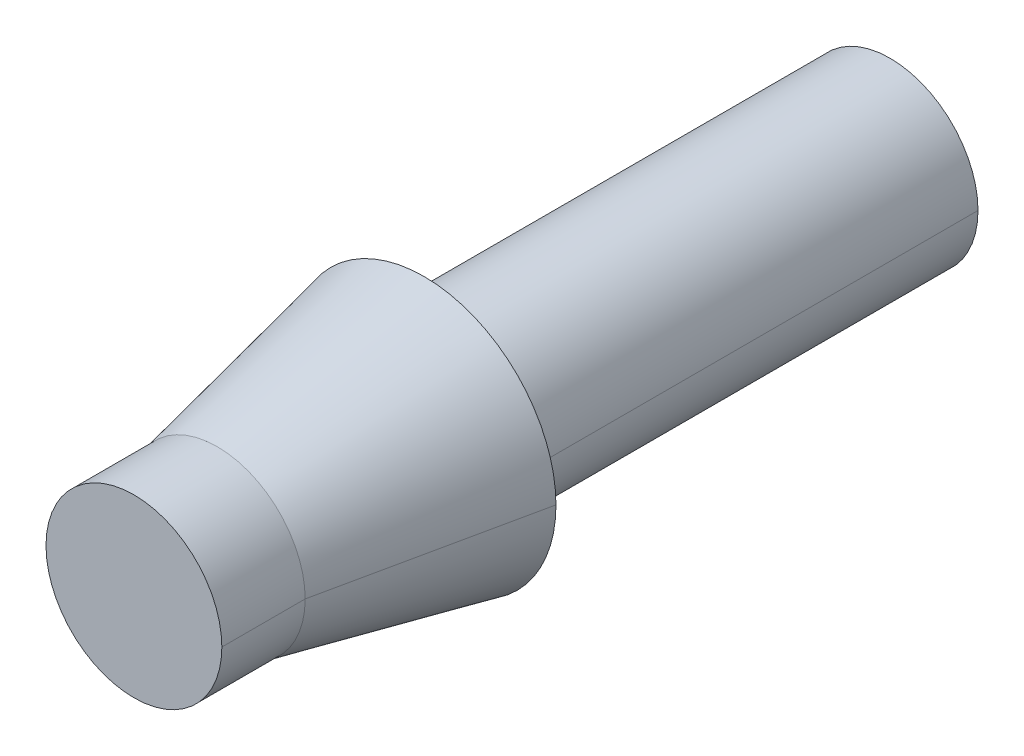
ISO-10303-21;
HEADER;
FILE_DESCRIPTION(('STEP AP214'),'2;1');
FILE_NAME('part.step','',(''),(''),'','','');
FILE_SCHEMA(('AUTOMOTIVE_DESIGN { 1 0 10303 214 1 1 1 1 }'));
ENDSEC;
DATA;
#1=APPLICATION_CONTEXT('core data for automotive mechanical design processes');
#2=APPLICATION_PROTOCOL_DEFINITION('international standard','automotive_design',2000,#1);
#3=PRODUCT_CONTEXT('',#1,'mechanical');
#4=PRODUCT('Part','Part','',(#3));
#5=PRODUCT_RELATED_PRODUCT_CATEGORY('part','',(#4));
#6=PRODUCT_DEFINITION_FORMATION('','',#4);
#7=PRODUCT_DEFINITION_CONTEXT('part definition',#1,'design');
#8=PRODUCT_DEFINITION('design','',#6,#7);
#9=PRODUCT_DEFINITION_SHAPE('','',#8);
#10=(LENGTH_UNIT() NAMED_UNIT(*) SI_UNIT(.MILLI.,.METRE.));
#11=(NAMED_UNIT(*) PLANE_ANGLE_UNIT() SI_UNIT($,.RADIAN.));
#12=(NAMED_UNIT(*) SI_UNIT($,.STERADIAN.) SOLID_ANGLE_UNIT());
#13=UNCERTAINTY_MEASURE_WITH_UNIT(LENGTH_MEASURE(1.E-05),#10,'distance_accuracy_value','');
#14=(GEOMETRIC_REPRESENTATION_CONTEXT(3) GLOBAL_UNCERTAINTY_ASSIGNED_CONTEXT((#13)) GLOBAL_UNIT_ASSIGNED_CONTEXT((#10,
#11,#12)) REPRESENTATION_CONTEXT('',''));
#15=CARTESIAN_POINT('',(0.,0.,0.));
#16=DIRECTION('',(0.,0.,1.));
#17=DIRECTION('',(1.,0.,0.));
#18=AXIS2_PLACEMENT_3D('',#15,#16,#17);
#19=CARTESIAN_POINT('',(0.,0.,43.));
#20=DIRECTION('',(0.,0.,-1.));
#21=DIRECTION('',(-1.,0.,0.));
#22=AXIS2_PLACEMENT_3D('',#19,#20,#21);
#23=CYLINDRICAL_SURFACE('',#22,5.);
#24=DIRECTION('',(0.,0.,-1.));
#25=VECTOR('',#24,1.);
#26=CARTESIAN_POINT('',(5.,0.,43.));
#27=LINE('',#26,#25);
#28=CARTESIAN_POINT('',(5.,0.,26.5));
#29=VERTEX_POINT('',#28);
#30=CARTESIAN_POINT('',(5.,0.,0.));
#31=VERTEX_POINT('',#30);
#32=EDGE_CURVE('E100',#29,#31,#27,.T.);
#33=ORIENTED_EDGE('',*,*,#32,.F.);
#34=CARTESIAN_POINT('',(0.,0.,26.5));
#35=DIRECTION('',(0.,0.,1.));
#36=DIRECTION('',(1.,0.,0.));
#37=AXIS2_PLACEMENT_3D('',#34,#35,#36);
#38=CIRCLE('',#37,5.);
#39=CARTESIAN_POINT('',(-5.,0.,26.5));
#40=VERTEX_POINT('',#39);
#41=EDGE_CURVE('E27',#40,#29,#38,.T.);
#42=ORIENTED_EDGE('',*,*,#41,.F.);
#43=DIRECTION('',(0.,0.,-1.));
#44=VECTOR('',#43,1.);
#45=CARTESIAN_POINT('',(-5.,0.,43.));
#46=LINE('',#45,#44);
#47=CARTESIAN_POINT('',(-5.,0.,0.));
#48=VERTEX_POINT('',#47);
#49=EDGE_CURVE('E107',#40,#48,#46,.T.);
#50=ORIENTED_EDGE('',*,*,#49,.T.);
#51=CARTESIAN_POINT('',(0.,0.,0.));
#52=DIRECTION('',(0.,0.,1.));
#53=DIRECTION('',(1.,0.,0.));
#54=AXIS2_PLACEMENT_3D('',#51,#52,#53);
#55=CIRCLE('',#54,5.);
#56=EDGE_CURVE('E10',#48,#31,#55,.T.);
#57=ORIENTED_EDGE('',*,*,#56,.T.);
#58=EDGE_LOOP('',(#33,#42,#50,#57));
#59=FACE_BOUND('',#58,.T.);
#60=ADVANCED_FACE('F16',(#59),#23,.T.);
#61=CARTESIAN_POINT('',(0.,0.,0.));
#62=DIRECTION('',(0.,0.,1.));
#63=DIRECTION('',(1.,0.,0.));
#64=AXIS2_PLACEMENT_3D('',#61,#62,#63);
#65=PLANE('',#64);
#66=ORIENTED_EDGE('',*,*,#56,.F.);
#67=CARTESIAN_POINT('',(0.,0.,0.));
#68=DIRECTION('',(0.,0.,1.));
#69=DIRECTION('',(1.,0.,0.));
#70=AXIS2_PLACEMENT_3D('',#67,#68,#69);
#71=CIRCLE('',#70,5.);
#72=EDGE_CURVE('E20',#31,#48,#71,.T.);
#73=ORIENTED_EDGE('',*,*,#72,.F.);
#74=EDGE_LOOP('',(#66,#73));
#75=FACE_BOUND('',#74,.T.);
#76=ADVANCED_FACE('F229',(#75),#65,.F.);
#77=CARTESIAN_POINT('',(0.,0.,26.5));
#78=DIRECTION('',(0.,0.,1.));
#79=DIRECTION('',(1.,0.,0.));
#80=AXIS2_PLACEMENT_3D('',#77,#78,#79);
#81=PLANE('',#80);
#82=ORIENTED_EDGE('',*,*,#41,.T.);
#83=CARTESIAN_POINT('',(0.,0.,26.5));
#84=DIRECTION('',(0.,0.,1.));
#85=DIRECTION('',(1.,0.,0.));
#86=AXIS2_PLACEMENT_3D('',#83,#84,#85);
#87=CIRCLE('',#86,5.);
#88=EDGE_CURVE('E93',#29,#40,#87,.T.);
#89=ORIENTED_EDGE('',*,*,#88,.T.);
#90=EDGE_LOOP('',(#82,#89));
#91=FACE_BOUND('',#90,.T.);
#92=CARTESIAN_POINT('',(0.,0.,26.5));
#93=DIRECTION('',(0.,0.,1.));
#94=DIRECTION('',(1.,0.,0.));
#95=AXIS2_PLACEMENT_3D('',#92,#93,#94);
#96=CIRCLE('',#95,7.5);
#97=CARTESIAN_POINT('',(7.5,0.,26.5));
#98=VERTEX_POINT('',#97);
#99=CARTESIAN_POINT('',(-7.5,0.,26.5));
#100=VERTEX_POINT('',#99);
#101=EDGE_CURVE('E67',#98,#100,#96,.T.);
#102=ORIENTED_EDGE('',*,*,#101,.F.);
#103=CARTESIAN_POINT('',(0.,0.,26.5));
#104=DIRECTION('',(0.,0.,1.));
#105=DIRECTION('',(1.,0.,0.));
#106=AXIS2_PLACEMENT_3D('',#103,#104,#105);
#107=CIRCLE('',#106,7.5);
#108=EDGE_CURVE('E114',#100,#98,#107,.T.);
#109=ORIENTED_EDGE('',*,*,#108,.F.);
#110=EDGE_LOOP('',(#102,#109));
#111=FACE_BOUND('',#110,.T.);
#112=ADVANCED_FACE('F18',(#91,#111),#81,.F.);
#113=CARTESIAN_POINT('',(0.,0.,26.5));
#114=DIRECTION('',(0.,0.,-1.));
#115=DIRECTION('',(1.,0.,0.));
#116=AXIS2_PLACEMENT_3D('',#113,#114,#115);
#117=CONICAL_SURFACE('',#116,7.5,0.209439510239319);
#118=DIRECTION('',(-0.207911690817759,0.,-0.978147600733806));
#119=VECTOR('',#118,1.);
#120=CARTESIAN_POINT('',(-7.5,0.,26.5));
#121=LINE('',#120,#119);
#122=CARTESIAN_POINT('',(-5.,0.,38.2615752736962));
#123=VERTEX_POINT('',#122);
#124=EDGE_CURVE('E118',#123,#100,#121,.T.);
#125=ORIENTED_EDGE('',*,*,#124,.F.);
#126=CARTESIAN_POINT('',(0.,0.,38.2615752736962));
#127=DIRECTION('',(0.,0.,-1.));
#128=DIRECTION('',(-1.,0.,0.));
#129=AXIS2_PLACEMENT_3D('',#126,#127,#128);
#130=CIRCLE('',#129,5.);
#131=CARTESIAN_POINT('',(5.,0.,38.2615752736962));
#132=VERTEX_POINT('',#131);
#133=EDGE_CURVE('E127',#123,#132,#130,.T.);
#134=ORIENTED_EDGE('',*,*,#133,.T.);
#135=DIRECTION('',(0.207911690817759,0.,-0.978147600733806));
#136=VECTOR('',#135,1.);
#137=CARTESIAN_POINT('',(7.5,0.,26.5));
#138=LINE('',#137,#136);
#139=EDGE_CURVE('E117',#132,#98,#138,.T.);
#140=ORIENTED_EDGE('',*,*,#139,.T.);
#141=ORIENTED_EDGE('',*,*,#101,.T.);
#142=EDGE_LOOP('',(#125,#134,#140,#141));
#143=FACE_BOUND('',#142,.T.);
#144=ADVANCED_FACE('F271',(#143),#117,.T.);
#145=CARTESIAN_POINT('',(0.,0.,43.));
#146=DIRECTION('',(0.,0.,1.));
#147=DIRECTION('',(1.,0.,0.));
#148=AXIS2_PLACEMENT_3D('',#145,#146,#147);
#149=PLANE('',#148);
#150=CARTESIAN_POINT('',(0.,0.,43.));
#151=DIRECTION('',(0.,0.,1.));
#152=DIRECTION('',(1.,0.,0.));
#153=AXIS2_PLACEMENT_3D('',#150,#151,#152);
#154=CIRCLE('',#153,5.);
#155=CARTESIAN_POINT('',(-5.,0.,43.));
#156=VERTEX_POINT('',#155);
#157=CARTESIAN_POINT('',(5.,0.,43.));
#158=VERTEX_POINT('',#157);
#159=EDGE_CURVE('E41',#156,#158,#154,.T.);
#160=ORIENTED_EDGE('',*,*,#159,.T.);
#161=CARTESIAN_POINT('',(0.,0.,43.));
#162=DIRECTION('',(0.,0.,1.));
#163=DIRECTION('',(1.,0.,0.));
#164=AXIS2_PLACEMENT_3D('',#161,#162,#163);
#165=CIRCLE('',#164,5.);
#166=EDGE_CURVE('E126',#158,#156,#165,.T.);
#167=ORIENTED_EDGE('',*,*,#166,.T.);
#168=EDGE_LOOP('',(#160,#167));
#169=FACE_BOUND('',#168,.T.);
#170=ADVANCED_FACE('F263',(#169),#149,.T.);
#171=CARTESIAN_POINT('',(0.,0.,43.));
#172=DIRECTION('',(0.,0.,-1.));
#173=DIRECTION('',(-1.,0.,0.));
#174=AXIS2_PLACEMENT_3D('',#171,#172,#173);
#175=CYLINDRICAL_SURFACE('',#174,5.);
#176=DIRECTION('',(0.,0.,-1.));
#177=VECTOR('',#176,1.);
#178=CARTESIAN_POINT('',(5.,0.,43.));
#179=LINE('',#178,#177);
#180=EDGE_CURVE('E130',#158,#132,#179,.T.);
#181=ORIENTED_EDGE('',*,*,#180,.F.);
#182=ORIENTED_EDGE('',*,*,#159,.F.);
#183=DIRECTION('',(0.,0.,-1.));
#184=VECTOR('',#183,1.);
#185=CARTESIAN_POINT('',(-5.,0.,43.));
#186=LINE('',#185,#184);
#187=EDGE_CURVE('E78',#156,#123,#186,.T.);
#188=ORIENTED_EDGE('',*,*,#187,.T.);
#189=CARTESIAN_POINT('',(0.,0.,38.2615752736962));
#190=DIRECTION('',(0.,0.,-1.));
#191=DIRECTION('',(-1.,0.,0.));
#192=AXIS2_PLACEMENT_3D('',#189,#190,#191);
#193=CIRCLE('',#192,5.);
#194=EDGE_CURVE('E120',#132,#123,#193,.T.);
#195=ORIENTED_EDGE('',*,*,#194,.F.);
#196=EDGE_LOOP('',(#181,#182,#188,#195));
#197=FACE_BOUND('',#196,.T.);
#198=ADVANCED_FACE('F246',(#197),#175,.T.);
#199=CARTESIAN_POINT('',(0.,0.,43.));
#200=DIRECTION('',(0.,0.,-1.));
#201=DIRECTION('',(-1.,0.,0.));
#202=AXIS2_PLACEMENT_3D('',#199,#200,#201);
#203=CYLINDRICAL_SURFACE('',#202,5.);
#204=ORIENTED_EDGE('',*,*,#166,.F.);
#205=ORIENTED_EDGE('',*,*,#180,.T.);
#206=ORIENTED_EDGE('',*,*,#133,.F.);
#207=ORIENTED_EDGE('',*,*,#187,.F.);
#208=EDGE_LOOP('',(#204,#205,#206,#207));
#209=FACE_BOUND('',#208,.T.);
#210=ADVANCED_FACE('F242',(#209),#203,.T.);
#211=CARTESIAN_POINT('',(0.,0.,26.5));
#212=DIRECTION('',(0.,0.,-1.));
#213=DIRECTION('',(1.,0.,0.));
#214=AXIS2_PLACEMENT_3D('',#211,#212,#213);
#215=CONICAL_SURFACE('',#214,7.5,0.209439510239319);
#216=ORIENTED_EDGE('',*,*,#194,.T.);
#217=ORIENTED_EDGE('',*,*,#124,.T.);
#218=ORIENTED_EDGE('',*,*,#108,.T.);
#219=ORIENTED_EDGE('',*,*,#139,.F.);
#220=EDGE_LOOP('',(#216,#217,#218,#219));
#221=FACE_BOUND('',#220,.T.);
#222=ADVANCED_FACE('F221',(#221),#215,.T.);
#223=CARTESIAN_POINT('',(0.,0.,43.));
#224=DIRECTION('',(0.,0.,-1.));
#225=DIRECTION('',(-1.,0.,0.));
#226=AXIS2_PLACEMENT_3D('',#223,#224,#225);
#227=CYLINDRICAL_SURFACE('',#226,5.);
#228=ORIENTED_EDGE('',*,*,#88,.F.);
#229=ORIENTED_EDGE('',*,*,#32,.T.);
#230=ORIENTED_EDGE('',*,*,#72,.T.);
#231=ORIENTED_EDGE('',*,*,#49,.F.);
#232=EDGE_LOOP('',(#228,#229,#230,#231));
#233=FACE_BOUND('',#232,.T.);
#234=ADVANCED_FACE('F106',(#233),#227,.T.);
#235=CLOSED_SHELL('',(#60,#76,#112,#144,#170,#198,#210,#222,#234));
#236=MANIFOLD_SOLID_BREP('B1',#235);
#237=ADVANCED_BREP_SHAPE_REPRESENTATION('',(#18,#236),#14);
#238=SHAPE_DEFINITION_REPRESENTATION(#9,#237);
ENDSEC;
END-ISO-10303-21;
